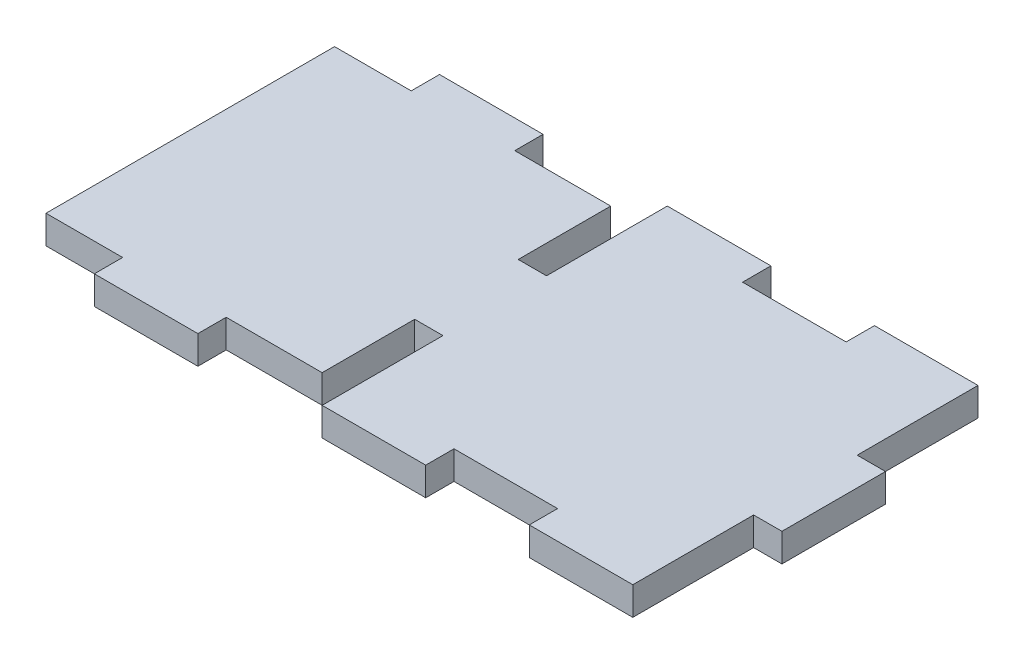
ISO-10303-21;
HEADER;
FILE_DESCRIPTION(('STEP AP214'),'2;1');
FILE_NAME('part.step','',(''),(''),'','','');
FILE_SCHEMA(('AUTOMOTIVE_DESIGN { 1 0 10303 214 1 1 1 1 }'));
ENDSEC;
DATA;
#1=APPLICATION_CONTEXT('core data for automotive mechanical design processes');
#2=APPLICATION_PROTOCOL_DEFINITION('international standard','automotive_design',2000,#1);
#3=PRODUCT_CONTEXT('',#1,'mechanical');
#4=PRODUCT('Part','Part','',(#3));
#5=PRODUCT_RELATED_PRODUCT_CATEGORY('part','',(#4));
#6=PRODUCT_DEFINITION_FORMATION('','',#4);
#7=PRODUCT_DEFINITION_CONTEXT('part definition',#1,'design');
#8=PRODUCT_DEFINITION('design','',#6,#7);
#9=PRODUCT_DEFINITION_SHAPE('','',#8);
#10=(LENGTH_UNIT() NAMED_UNIT(*) SI_UNIT(.MILLI.,.METRE.));
#11=(NAMED_UNIT(*) PLANE_ANGLE_UNIT() SI_UNIT($,.RADIAN.));
#12=(NAMED_UNIT(*) SI_UNIT($,.STERADIAN.) SOLID_ANGLE_UNIT());
#13=UNCERTAINTY_MEASURE_WITH_UNIT(LENGTH_MEASURE(1.E-05),#10,'distance_accuracy_value','');
#14=(GEOMETRIC_REPRESENTATION_CONTEXT(3) GLOBAL_UNCERTAINTY_ASSIGNED_CONTEXT((#13)) GLOBAL_UNIT_ASSIGNED_CONTEXT((#10,
#11,#12)) REPRESENTATION_CONTEXT('',''));
#15=CARTESIAN_POINT('',(0.,0.,0.));
#16=DIRECTION('',(0.,0.,1.));
#17=DIRECTION('',(1.,0.,0.));
#18=AXIS2_PLACEMENT_3D('',#15,#16,#17);
#19=CARTESIAN_POINT('',(0.,4.1,-17.5));
#20=DIRECTION('',(1.,0.,0.));
#21=DIRECTION('',(0.,0.,-1.));
#22=AXIS2_PLACEMENT_3D('',#19,#20,#21);
#23=PLANE('',#22);
#24=DIRECTION('',(0.,0.,1.));
#25=VECTOR('',#24,1.);
#26=CARTESIAN_POINT('',(0.,0.,-17.5));
#27=LINE('',#26,#25);
#28=CARTESIAN_POINT('',(0.,0.,-17.5));
#29=VERTEX_POINT('',#28);
#30=CARTESIAN_POINT('',(0.,0.,0.));
#31=VERTEX_POINT('',#30);
#32=EDGE_CURVE('E273',#29,#31,#27,.T.);
#33=ORIENTED_EDGE('',*,*,#32,.T.);
#34=DIRECTION('',(0.,-1.,0.));
#35=VECTOR('',#34,1.);
#36=CARTESIAN_POINT('',(0.,4.1,0.));
#37=LINE('',#36,#35);
#38=CARTESIAN_POINT('',(0.,4.1,0.));
#39=VERTEX_POINT('',#38);
#40=EDGE_CURVE('E11',#39,#31,#37,.T.);
#41=ORIENTED_EDGE('',*,*,#40,.F.);
#42=DIRECTION('',(0.,0.,1.));
#43=VECTOR('',#42,1.);
#44=CARTESIAN_POINT('',(0.,4.1,-17.5));
#45=LINE('',#44,#43);
#46=CARTESIAN_POINT('',(0.,4.1,-17.5));
#47=VERTEX_POINT('',#46);
#48=EDGE_CURVE('E335',#47,#39,#45,.T.);
#49=ORIENTED_EDGE('',*,*,#48,.F.);
#50=DIRECTION('',(0.,-1.,0.));
#51=VECTOR('',#50,1.);
#52=CARTESIAN_POINT('',(0.,4.1,-17.5));
#53=LINE('',#52,#51);
#54=EDGE_CURVE('E269',#47,#29,#53,.T.);
#55=ORIENTED_EDGE('',*,*,#54,.T.);
#56=EDGE_LOOP('',(#33,#41,#49,#55));
#57=FACE_BOUND('',#56,.T.);
#58=ADVANCED_FACE('F33',(#57),#23,.F.);
#59=CARTESIAN_POINT('',(0.,4.1,0.));
#60=DIRECTION('',(0.,0.,-1.));
#61=DIRECTION('',(-1.,0.,0.));
#62=AXIS2_PLACEMENT_3D('',#59,#60,#61);
#63=PLANE('',#62);
#64=DIRECTION('',(1.,0.,0.));
#65=VECTOR('',#64,1.);
#66=CARTESIAN_POINT('',(0.,0.,0.));
#67=LINE('',#66,#65);
#68=CARTESIAN_POINT('',(15.,0.,0.));
#69=VERTEX_POINT('',#68);
#70=EDGE_CURVE('E276',#31,#69,#67,.T.);
#71=ORIENTED_EDGE('',*,*,#70,.T.);
#72=DIRECTION('',(0.,-1.,0.));
#73=VECTOR('',#72,1.);
#74=CARTESIAN_POINT('',(15.,4.1,0.));
#75=LINE('',#74,#73);
#76=CARTESIAN_POINT('',(15.,4.1,0.));
#77=VERTEX_POINT('',#76);
#78=EDGE_CURVE('E41',#77,#69,#75,.T.);
#79=ORIENTED_EDGE('',*,*,#78,.F.);
#80=DIRECTION('',(1.,0.,0.));
#81=VECTOR('',#80,1.);
#82=CARTESIAN_POINT('',(0.,4.1,0.));
#83=LINE('',#82,#81);
#84=EDGE_CURVE('E164',#39,#77,#83,.T.);
#85=ORIENTED_EDGE('',*,*,#84,.F.);
#86=ORIENTED_EDGE('',*,*,#40,.T.);
#87=EDGE_LOOP('',(#71,#79,#85,#86));
#88=FACE_BOUND('',#87,.T.);
#89=ADVANCED_FACE('F513',(#88),#63,.F.);
#90=CARTESIAN_POINT('',(15.,4.1,0.));
#91=DIRECTION('',(-1.,0.,0.));
#92=DIRECTION('',(0.,0.,1.));
#93=AXIS2_PLACEMENT_3D('',#90,#91,#92);
#94=PLANE('',#93);
#95=DIRECTION('',(0.,0.,-1.));
#96=VECTOR('',#95,1.);
#97=CARTESIAN_POINT('',(15.,0.,0.));
#98=LINE('',#97,#96);
#99=CARTESIAN_POINT('',(15.,0.,-4.1));
#100=VERTEX_POINT('',#99);
#101=EDGE_CURVE('E278',#69,#100,#98,.T.);
#102=ORIENTED_EDGE('',*,*,#101,.T.);
#103=DIRECTION('',(0.,-1.,0.));
#104=VECTOR('',#103,1.);
#105=CARTESIAN_POINT('',(15.,4.1,-4.1));
#106=LINE('',#105,#104);
#107=CARTESIAN_POINT('',(15.,4.1,-4.1));
#108=VERTEX_POINT('',#107);
#109=EDGE_CURVE('E414',#108,#100,#106,.T.);
#110=ORIENTED_EDGE('',*,*,#109,.F.);
#111=DIRECTION('',(0.,0.,-1.));
#112=VECTOR('',#111,1.);
#113=CARTESIAN_POINT('',(15.,4.1,0.));
#114=LINE('',#113,#112);
#115=EDGE_CURVE('E422',#77,#108,#114,.T.);
#116=ORIENTED_EDGE('',*,*,#115,.F.);
#117=ORIENTED_EDGE('',*,*,#78,.T.);
#118=EDGE_LOOP('',(#102,#110,#116,#117));
#119=FACE_BOUND('',#118,.T.);
#120=ADVANCED_FACE('F420',(#119),#94,.F.);
#121=CARTESIAN_POINT('',(15.,4.1,-4.1));
#122=DIRECTION('',(0.,0.,-1.));
#123=DIRECTION('',(-1.,0.,0.));
#124=AXIS2_PLACEMENT_3D('',#121,#122,#123);
#125=PLANE('',#124);
#126=DIRECTION('',(1.,0.,0.));
#127=VECTOR('',#126,1.);
#128=CARTESIAN_POINT('',(15.,0.,-4.1));
#129=LINE('',#128,#127);
#130=CARTESIAN_POINT('',(30.,0.,-4.1));
#131=VERTEX_POINT('',#130);
#132=EDGE_CURVE('E280',#100,#131,#129,.T.);
#133=ORIENTED_EDGE('',*,*,#132,.T.);
#134=DIRECTION('',(0.,-1.,0.));
#135=VECTOR('',#134,1.);
#136=CARTESIAN_POINT('',(30.,4.1,-4.1));
#137=LINE('',#136,#135);
#138=CARTESIAN_POINT('',(30.,4.1,-4.1));
#139=VERTEX_POINT('',#138);
#140=EDGE_CURVE('E411',#139,#131,#137,.T.);
#141=ORIENTED_EDGE('',*,*,#140,.F.);
#142=DIRECTION('',(1.,0.,0.));
#143=VECTOR('',#142,1.);
#144=CARTESIAN_POINT('',(15.,4.1,-4.1));
#145=LINE('',#144,#143);
#146=EDGE_CURVE('E440',#108,#139,#145,.T.);
#147=ORIENTED_EDGE('',*,*,#146,.F.);
#148=ORIENTED_EDGE('',*,*,#109,.T.);
#149=EDGE_LOOP('',(#133,#141,#147,#148));
#150=FACE_BOUND('',#149,.T.);
#151=ADVANCED_FACE('F431',(#150),#125,.F.);
#152=CARTESIAN_POINT('',(30.,4.1,-4.1));
#153=DIRECTION('',(1.,0.,0.));
#154=DIRECTION('',(0.,0.,-1.));
#155=AXIS2_PLACEMENT_3D('',#152,#153,#154);
#156=PLANE('',#155);
#157=DIRECTION('',(0.,0.,1.));
#158=VECTOR('',#157,1.);
#159=CARTESIAN_POINT('',(30.,0.,-4.1));
#160=LINE('',#159,#158);
#161=CARTESIAN_POINT('',(30.,0.,0.));
#162=VERTEX_POINT('',#161);
#163=EDGE_CURVE('E282',#131,#162,#160,.T.);
#164=ORIENTED_EDGE('',*,*,#163,.T.);
#165=DIRECTION('',(0.,-1.,0.));
#166=VECTOR('',#165,1.);
#167=CARTESIAN_POINT('',(30.,4.1,0.));
#168=LINE('',#167,#166);
#169=CARTESIAN_POINT('',(30.,4.1,0.));
#170=VERTEX_POINT('',#169);
#171=EDGE_CURVE('E408',#170,#162,#168,.T.);
#172=ORIENTED_EDGE('',*,*,#171,.F.);
#173=DIRECTION('',(0.,0.,1.));
#174=VECTOR('',#173,1.);
#175=CARTESIAN_POINT('',(30.,4.1,-4.1));
#176=LINE('',#175,#174);
#177=EDGE_CURVE('E437',#139,#170,#176,.T.);
#178=ORIENTED_EDGE('',*,*,#177,.F.);
#179=ORIENTED_EDGE('',*,*,#140,.T.);
#180=EDGE_LOOP('',(#164,#172,#178,#179));
#181=FACE_BOUND('',#180,.T.);
#182=ADVANCED_FACE('F435',(#181),#156,.F.);
#183=CARTESIAN_POINT('',(30.,4.1,0.));
#184=DIRECTION('',(0.,0.,-1.));
#185=DIRECTION('',(-1.,0.,0.));
#186=AXIS2_PLACEMENT_3D('',#183,#184,#185);
#187=PLANE('',#186);
#188=DIRECTION('',(1.,0.,0.));
#189=VECTOR('',#188,1.);
#190=CARTESIAN_POINT('',(30.,0.,0.));
#191=LINE('',#190,#189);
#192=CARTESIAN_POINT('',(45.,0.,0.));
#193=VERTEX_POINT('',#192);
#194=EDGE_CURVE('E284',#162,#193,#191,.T.);
#195=ORIENTED_EDGE('',*,*,#194,.T.);
#196=DIRECTION('',(0.,-1.,0.));
#197=VECTOR('',#196,1.);
#198=CARTESIAN_POINT('',(45.,4.1,0.));
#199=LINE('',#198,#197);
#200=CARTESIAN_POINT('',(45.,4.1,0.));
#201=VERTEX_POINT('',#200);
#202=EDGE_CURVE('E405',#201,#193,#199,.T.);
#203=ORIENTED_EDGE('',*,*,#202,.F.);
#204=DIRECTION('',(1.,0.,0.));
#205=VECTOR('',#204,1.);
#206=CARTESIAN_POINT('',(30.,4.1,0.));
#207=LINE('',#206,#205);
#208=EDGE_CURVE('E439',#170,#201,#207,.T.);
#209=ORIENTED_EDGE('',*,*,#208,.F.);
#210=ORIENTED_EDGE('',*,*,#171,.T.);
#211=EDGE_LOOP('',(#195,#203,#209,#210));
#212=FACE_BOUND('',#211,.T.);
#213=ADVANCED_FACE('F526',(#212),#187,.F.);
#214=CARTESIAN_POINT('',(45.,4.1,0.));
#215=DIRECTION('',(-1.,0.,0.));
#216=DIRECTION('',(0.,0.,1.));
#217=AXIS2_PLACEMENT_3D('',#214,#215,#216);
#218=PLANE('',#217);
#219=DIRECTION('',(0.,0.,-1.));
#220=VECTOR('',#219,1.);
#221=CARTESIAN_POINT('',(45.,0.,0.));
#222=LINE('',#221,#220);
#223=CARTESIAN_POINT('',(45.,0.,-17.5));
#224=VERTEX_POINT('',#223);
#225=EDGE_CURVE('E286',#193,#224,#222,.T.);
#226=ORIENTED_EDGE('',*,*,#225,.T.);
#227=DIRECTION('',(0.,-1.,0.));
#228=VECTOR('',#227,1.);
#229=CARTESIAN_POINT('',(45.,4.1,-17.5));
#230=LINE('',#229,#228);
#231=CARTESIAN_POINT('',(45.,4.1,-17.5));
#232=VERTEX_POINT('',#231);
#233=EDGE_CURVE('E402',#232,#224,#230,.T.);
#234=ORIENTED_EDGE('',*,*,#233,.F.);
#235=DIRECTION('',(0.,0.,-1.));
#236=VECTOR('',#235,1.);
#237=CARTESIAN_POINT('',(45.,4.1,0.));
#238=LINE('',#237,#236);
#239=EDGE_CURVE('E442',#201,#232,#238,.T.);
#240=ORIENTED_EDGE('',*,*,#239,.F.);
#241=ORIENTED_EDGE('',*,*,#202,.T.);
#242=EDGE_LOOP('',(#226,#234,#240,#241));
#243=FACE_BOUND('',#242,.T.);
#244=ADVANCED_FACE('F529',(#243),#218,.F.);
#245=CARTESIAN_POINT('',(49.1,4.1,-17.5));
#246=DIRECTION('',(0.,0.,-1.));
#247=DIRECTION('',(-1.,0.,0.));
#248=AXIS2_PLACEMENT_3D('',#245,#246,#247);
#249=PLANE('',#248);
#250=DIRECTION('',(1.,0.,0.));
#251=VECTOR('',#250,1.);
#252=CARTESIAN_POINT('',(49.1,0.,-17.5));
#253=LINE('',#252,#251);
#254=CARTESIAN_POINT('',(49.1,0.,-17.5));
#255=VERTEX_POINT('',#254);
#256=EDGE_CURVE('E288',#224,#255,#253,.T.);
#257=ORIENTED_EDGE('',*,*,#256,.T.);
#258=DIRECTION('',(0.,-1.,0.));
#259=VECTOR('',#258,1.);
#260=CARTESIAN_POINT('',(49.1,4.1,-17.5));
#261=LINE('',#260,#259);
#262=CARTESIAN_POINT('',(49.1,4.1,-17.5));
#263=VERTEX_POINT('',#262);
#264=EDGE_CURVE('E399',#263,#255,#261,.T.);
#265=ORIENTED_EDGE('',*,*,#264,.F.);
#266=DIRECTION('',(1.,0.,0.));
#267=VECTOR('',#266,1.);
#268=CARTESIAN_POINT('',(49.1,4.1,-17.5));
#269=LINE('',#268,#267);
#270=EDGE_CURVE('E448',#232,#263,#269,.T.);
#271=ORIENTED_EDGE('',*,*,#270,.F.);
#272=ORIENTED_EDGE('',*,*,#233,.T.);
#273=EDGE_LOOP('',(#257,#265,#271,#272));
#274=FACE_BOUND('',#273,.T.);
#275=ADVANCED_FACE('F533',(#274),#249,.F.);
#276=CARTESIAN_POINT('',(49.1,4.1,-32.5));
#277=DIRECTION('',(-1.,0.,0.));
#278=DIRECTION('',(0.,0.,1.));
#279=AXIS2_PLACEMENT_3D('',#276,#277,#278);
#280=PLANE('',#279);
#281=DIRECTION('',(0.,0.,-1.));
#282=VECTOR('',#281,1.);
#283=CARTESIAN_POINT('',(49.1,0.,-32.5));
#284=LINE('',#283,#282);
#285=CARTESIAN_POINT('',(49.1,0.,-32.5));
#286=VERTEX_POINT('',#285);
#287=EDGE_CURVE('E290',#255,#286,#284,.T.);
#288=ORIENTED_EDGE('',*,*,#287,.T.);
#289=DIRECTION('',(0.,-1.,0.));
#290=VECTOR('',#289,1.);
#291=CARTESIAN_POINT('',(49.1,4.1,-32.5));
#292=LINE('',#291,#290);
#293=CARTESIAN_POINT('',(49.1,4.1,-32.5));
#294=VERTEX_POINT('',#293);
#295=EDGE_CURVE('E396',#294,#286,#292,.T.);
#296=ORIENTED_EDGE('',*,*,#295,.F.);
#297=DIRECTION('',(0.,0.,-1.));
#298=VECTOR('',#297,1.);
#299=CARTESIAN_POINT('',(49.1,4.1,-32.5));
#300=LINE('',#299,#298);
#301=EDGE_CURVE('E450',#263,#294,#300,.T.);
#302=ORIENTED_EDGE('',*,*,#301,.F.);
#303=ORIENTED_EDGE('',*,*,#264,.T.);
#304=EDGE_LOOP('',(#288,#296,#302,#303));
#305=FACE_BOUND('',#304,.T.);
#306=ADVANCED_FACE('F537',(#305),#280,.F.);
#307=CARTESIAN_POINT('',(45.,4.1,-32.5));
#308=DIRECTION('',(0.,0.,1.));
#309=DIRECTION('',(1.,0.,0.));
#310=AXIS2_PLACEMENT_3D('',#307,#308,#309);
#311=PLANE('',#310);
#312=DIRECTION('',(-1.,0.,0.));
#313=VECTOR('',#312,1.);
#314=CARTESIAN_POINT('',(45.,0.,-32.5));
#315=LINE('',#314,#313);
#316=CARTESIAN_POINT('',(45.,0.,-32.5));
#317=VERTEX_POINT('',#316);
#318=EDGE_CURVE('E292',#286,#317,#315,.T.);
#319=ORIENTED_EDGE('',*,*,#318,.T.);
#320=DIRECTION('',(0.,-1.,0.));
#321=VECTOR('',#320,1.);
#322=CARTESIAN_POINT('',(45.,4.1,-32.5));
#323=LINE('',#322,#321);
#324=CARTESIAN_POINT('',(45.,4.1,-32.5));
#325=VERTEX_POINT('',#324);
#326=EDGE_CURVE('E393',#325,#317,#323,.T.);
#327=ORIENTED_EDGE('',*,*,#326,.F.);
#328=DIRECTION('',(-1.,0.,0.));
#329=VECTOR('',#328,1.);
#330=CARTESIAN_POINT('',(45.,4.1,-32.5));
#331=LINE('',#330,#329);
#332=EDGE_CURVE('E452',#294,#325,#331,.T.);
#333=ORIENTED_EDGE('',*,*,#332,.F.);
#334=ORIENTED_EDGE('',*,*,#295,.T.);
#335=EDGE_LOOP('',(#319,#327,#333,#334));
#336=FACE_BOUND('',#335,.T.);
#337=ADVANCED_FACE('F541',(#336),#311,.F.);
#338=CARTESIAN_POINT('',(45.,4.1,-32.5));
#339=DIRECTION('',(-1.,0.,0.));
#340=DIRECTION('',(0.,0.,1.));
#341=AXIS2_PLACEMENT_3D('',#338,#339,#340);
#342=PLANE('',#341);
#343=DIRECTION('',(0.,0.,-1.));
#344=VECTOR('',#343,1.);
#345=CARTESIAN_POINT('',(45.,0.,-32.5));
#346=LINE('',#345,#344);
#347=CARTESIAN_POINT('',(45.,0.,-50.));
#348=VERTEX_POINT('',#347);
#349=EDGE_CURVE('E294',#317,#348,#346,.T.);
#350=ORIENTED_EDGE('',*,*,#349,.T.);
#351=DIRECTION('',(0.,-1.,0.));
#352=VECTOR('',#351,1.);
#353=CARTESIAN_POINT('',(45.,4.1,-50.));
#354=LINE('',#353,#352);
#355=CARTESIAN_POINT('',(45.,4.1,-50.));
#356=VERTEX_POINT('',#355);
#357=EDGE_CURVE('E390',#356,#348,#354,.T.);
#358=ORIENTED_EDGE('',*,*,#357,.F.);
#359=DIRECTION('',(0.,0.,-1.));
#360=VECTOR('',#359,1.);
#361=CARTESIAN_POINT('',(45.,4.1,-32.5));
#362=LINE('',#361,#360);
#363=EDGE_CURVE('E454',#325,#356,#362,.T.);
#364=ORIENTED_EDGE('',*,*,#363,.F.);
#365=ORIENTED_EDGE('',*,*,#326,.T.);
#366=EDGE_LOOP('',(#350,#358,#364,#365));
#367=FACE_BOUND('',#366,.T.);
#368=ADVANCED_FACE('F545',(#367),#342,.F.);
#369=CARTESIAN_POINT('',(30.,4.1,-50.));
#370=DIRECTION('',(0.,0.,1.));
#371=DIRECTION('',(1.,0.,0.));
#372=AXIS2_PLACEMENT_3D('',#369,#370,#371);
#373=PLANE('',#372);
#374=DIRECTION('',(-1.,0.,0.));
#375=VECTOR('',#374,1.);
#376=CARTESIAN_POINT('',(30.,0.,-50.));
#377=LINE('',#376,#375);
#378=CARTESIAN_POINT('',(30.,0.,-50.));
#379=VERTEX_POINT('',#378);
#380=EDGE_CURVE('E296',#348,#379,#377,.T.);
#381=ORIENTED_EDGE('',*,*,#380,.T.);
#382=DIRECTION('',(0.,-1.,0.));
#383=VECTOR('',#382,1.);
#384=CARTESIAN_POINT('',(30.,4.1,-50.));
#385=LINE('',#384,#383);
#386=CARTESIAN_POINT('',(30.,4.1,-50.));
#387=VERTEX_POINT('',#386);
#388=EDGE_CURVE('E387',#387,#379,#385,.T.);
#389=ORIENTED_EDGE('',*,*,#388,.F.);
#390=DIRECTION('',(-1.,0.,0.));
#391=VECTOR('',#390,1.);
#392=CARTESIAN_POINT('',(30.,4.1,-50.));
#393=LINE('',#392,#391);
#394=EDGE_CURVE('E456',#356,#387,#393,.T.);
#395=ORIENTED_EDGE('',*,*,#394,.F.);
#396=ORIENTED_EDGE('',*,*,#357,.T.);
#397=EDGE_LOOP('',(#381,#389,#395,#396));
#398=FACE_BOUND('',#397,.T.);
#399=ADVANCED_FACE('F549',(#398),#373,.F.);
#400=CARTESIAN_POINT('',(30.,4.1,-45.9));
#401=DIRECTION('',(1.,0.,0.));
#402=DIRECTION('',(0.,0.,-1.));
#403=AXIS2_PLACEMENT_3D('',#400,#401,#402);
#404=PLANE('',#403);
#405=DIRECTION('',(0.,0.,1.));
#406=VECTOR('',#405,1.);
#407=CARTESIAN_POINT('',(30.,0.,-45.9));
#408=LINE('',#407,#406);
#409=CARTESIAN_POINT('',(30.,0.,-45.9));
#410=VERTEX_POINT('',#409);
#411=EDGE_CURVE('E298',#379,#410,#408,.T.);
#412=ORIENTED_EDGE('',*,*,#411,.T.);
#413=DIRECTION('',(0.,-1.,0.));
#414=VECTOR('',#413,1.);
#415=CARTESIAN_POINT('',(30.,4.1,-45.9));
#416=LINE('',#415,#414);
#417=CARTESIAN_POINT('',(30.,4.1,-45.9));
#418=VERTEX_POINT('',#417);
#419=EDGE_CURVE('E384',#418,#410,#416,.T.);
#420=ORIENTED_EDGE('',*,*,#419,.F.);
#421=DIRECTION('',(0.,0.,1.));
#422=VECTOR('',#421,1.);
#423=CARTESIAN_POINT('',(30.,4.1,-45.9));
#424=LINE('',#423,#422);
#425=EDGE_CURVE('E458',#387,#418,#424,.T.);
#426=ORIENTED_EDGE('',*,*,#425,.F.);
#427=ORIENTED_EDGE('',*,*,#388,.T.);
#428=EDGE_LOOP('',(#412,#420,#426,#427));
#429=FACE_BOUND('',#428,.T.);
#430=ADVANCED_FACE('F553',(#429),#404,.F.);
#431=CARTESIAN_POINT('',(15.,4.1,-45.9));
#432=DIRECTION('',(0.,0.,1.));
#433=DIRECTION('',(1.,0.,0.));
#434=AXIS2_PLACEMENT_3D('',#431,#432,#433);
#435=PLANE('',#434);
#436=DIRECTION('',(-1.,0.,0.));
#437=VECTOR('',#436,1.);
#438=CARTESIAN_POINT('',(15.,0.,-45.9));
#439=LINE('',#438,#437);
#440=CARTESIAN_POINT('',(15.,0.,-45.9));
#441=VERTEX_POINT('',#440);
#442=EDGE_CURVE('E300',#410,#441,#439,.T.);
#443=ORIENTED_EDGE('',*,*,#442,.T.);
#444=DIRECTION('',(0.,-1.,0.));
#445=VECTOR('',#444,1.);
#446=CARTESIAN_POINT('',(15.,4.1,-45.9));
#447=LINE('',#446,#445);
#448=CARTESIAN_POINT('',(15.,4.1,-45.9));
#449=VERTEX_POINT('',#448);
#450=EDGE_CURVE('E381',#449,#441,#447,.T.);
#451=ORIENTED_EDGE('',*,*,#450,.F.);
#452=DIRECTION('',(-1.,0.,0.));
#453=VECTOR('',#452,1.);
#454=CARTESIAN_POINT('',(15.,4.1,-45.9));
#455=LINE('',#454,#453);
#456=EDGE_CURVE('E460',#418,#449,#455,.T.);
#457=ORIENTED_EDGE('',*,*,#456,.F.);
#458=ORIENTED_EDGE('',*,*,#419,.T.);
#459=EDGE_LOOP('',(#443,#451,#457,#458));
#460=FACE_BOUND('',#459,.T.);
#461=ADVANCED_FACE('F557',(#460),#435,.F.);
#462=CARTESIAN_POINT('',(15.,4.1,-50.));
#463=DIRECTION('',(-1.,0.,0.));
#464=DIRECTION('',(0.,0.,1.));
#465=AXIS2_PLACEMENT_3D('',#462,#463,#464);
#466=PLANE('',#465);
#467=DIRECTION('',(0.,0.,-1.));
#468=VECTOR('',#467,1.);
#469=CARTESIAN_POINT('',(15.,0.,-50.));
#470=LINE('',#469,#468);
#471=CARTESIAN_POINT('',(15.,0.,-50.));
#472=VERTEX_POINT('',#471);
#473=EDGE_CURVE('E302',#441,#472,#470,.T.);
#474=ORIENTED_EDGE('',*,*,#473,.T.);
#475=DIRECTION('',(0.,-1.,0.));
#476=VECTOR('',#475,1.);
#477=CARTESIAN_POINT('',(15.,4.1,-50.));
#478=LINE('',#477,#476);
#479=CARTESIAN_POINT('',(15.,4.1,-50.));
#480=VERTEX_POINT('',#479);
#481=EDGE_CURVE('E378',#480,#472,#478,.T.);
#482=ORIENTED_EDGE('',*,*,#481,.F.);
#483=DIRECTION('',(0.,0.,-1.));
#484=VECTOR('',#483,1.);
#485=CARTESIAN_POINT('',(15.,4.1,-50.));
#486=LINE('',#485,#484);
#487=EDGE_CURVE('E462',#449,#480,#486,.T.);
#488=ORIENTED_EDGE('',*,*,#487,.F.);
#489=ORIENTED_EDGE('',*,*,#450,.T.);
#490=EDGE_LOOP('',(#474,#482,#488,#489));
#491=FACE_BOUND('',#490,.T.);
#492=ADVANCED_FACE('F561',(#491),#466,.F.);
#493=CARTESIAN_POINT('',(0.,4.1,-50.));
#494=DIRECTION('',(0.,0.,1.));
#495=DIRECTION('',(1.,0.,0.));
#496=AXIS2_PLACEMENT_3D('',#493,#494,#495);
#497=PLANE('',#496);
#498=DIRECTION('',(-1.,0.,0.));
#499=VECTOR('',#498,1.);
#500=CARTESIAN_POINT('',(0.,0.,-50.));
#501=LINE('',#500,#499);
#502=CARTESIAN_POINT('',(0.,0.,-50.));
#503=VERTEX_POINT('',#502);
#504=EDGE_CURVE('E304',#472,#503,#501,.T.);
#505=ORIENTED_EDGE('',*,*,#504,.T.);
#506=DIRECTION('',(0.,-1.,0.));
#507=VECTOR('',#506,1.);
#508=CARTESIAN_POINT('',(0.,4.1,-50.));
#509=LINE('',#508,#507);
#510=CARTESIAN_POINT('',(0.,4.1,-50.));
#511=VERTEX_POINT('',#510);
#512=EDGE_CURVE('E375',#511,#503,#509,.T.);
#513=ORIENTED_EDGE('',*,*,#512,.F.);
#514=DIRECTION('',(-1.,0.,0.));
#515=VECTOR('',#514,1.);
#516=CARTESIAN_POINT('',(0.,4.1,-50.));
#517=LINE('',#516,#515);
#518=EDGE_CURVE('E464',#480,#511,#517,.T.);
#519=ORIENTED_EDGE('',*,*,#518,.F.);
#520=ORIENTED_EDGE('',*,*,#481,.T.);
#521=EDGE_LOOP('',(#505,#513,#519,#520));
#522=FACE_BOUND('',#521,.T.);
#523=ADVANCED_FACE('F565',(#522),#497,.F.);
#524=CARTESIAN_POINT('',(0.,4.1,-50.));
#525=DIRECTION('',(1.,0.,0.));
#526=DIRECTION('',(0.,0.,-1.));
#527=AXIS2_PLACEMENT_3D('',#524,#525,#526);
#528=PLANE('',#527);
#529=DIRECTION('',(0.,0.,1.));
#530=VECTOR('',#529,1.);
#531=CARTESIAN_POINT('',(0.,0.,-50.));
#532=LINE('',#531,#530);
#533=CARTESIAN_POINT('',(0.,0.,-32.5));
#534=VERTEX_POINT('',#533);
#535=EDGE_CURVE('E306',#503,#534,#532,.T.);
#536=ORIENTED_EDGE('',*,*,#535,.T.);
#537=DIRECTION('',(0.,-1.,0.));
#538=VECTOR('',#537,1.);
#539=CARTESIAN_POINT('',(0.,4.1,-32.5));
#540=LINE('',#539,#538);
#541=CARTESIAN_POINT('',(0.,4.1,-32.5));
#542=VERTEX_POINT('',#541);
#543=EDGE_CURVE('E372',#542,#534,#540,.T.);
#544=ORIENTED_EDGE('',*,*,#543,.F.);
#545=DIRECTION('',(0.,0.,1.));
#546=VECTOR('',#545,1.);
#547=CARTESIAN_POINT('',(0.,4.1,-50.));
#548=LINE('',#547,#546);
#549=EDGE_CURVE('E466',#511,#542,#548,.T.);
#550=ORIENTED_EDGE('',*,*,#549,.F.);
#551=ORIENTED_EDGE('',*,*,#512,.T.);
#552=EDGE_LOOP('',(#536,#544,#550,#551));
#553=FACE_BOUND('',#552,.T.);
#554=ADVANCED_FACE('F569',(#553),#528,.F.);
#555=CARTESIAN_POINT('',(0.,4.1,-32.5));
#556=DIRECTION('',(0.,0.,1.));
#557=DIRECTION('',(1.,0.,0.));
#558=AXIS2_PLACEMENT_3D('',#555,#556,#557);
#559=PLANE('',#558);
#560=DIRECTION('',(-1.,0.,0.));
#561=VECTOR('',#560,1.);
#562=CARTESIAN_POINT('',(0.,0.,-32.5));
#563=LINE('',#562,#561);
#564=CARTESIAN_POINT('',(-4.1,0.,-32.5));
#565=VERTEX_POINT('',#564);
#566=EDGE_CURVE('E308',#534,#565,#563,.T.);
#567=ORIENTED_EDGE('',*,*,#566,.T.);
#568=DIRECTION('',(0.,-1.,0.));
#569=VECTOR('',#568,1.);
#570=CARTESIAN_POINT('',(-4.1,4.1,-32.5));
#571=LINE('',#570,#569);
#572=CARTESIAN_POINT('',(-4.1,4.1,-32.5));
#573=VERTEX_POINT('',#572);
#574=EDGE_CURVE('E369',#573,#565,#571,.T.);
#575=ORIENTED_EDGE('',*,*,#574,.F.);
#576=DIRECTION('',(-1.,0.,0.));
#577=VECTOR('',#576,1.);
#578=CARTESIAN_POINT('',(0.,4.1,-32.5));
#579=LINE('',#578,#577);
#580=EDGE_CURVE('E468',#542,#573,#579,.T.);
#581=ORIENTED_EDGE('',*,*,#580,.F.);
#582=ORIENTED_EDGE('',*,*,#543,.T.);
#583=EDGE_LOOP('',(#567,#575,#581,#582));
#584=FACE_BOUND('',#583,.T.);
#585=ADVANCED_FACE('F573',(#584),#559,.F.);
#586=CARTESIAN_POINT('',(-4.1,4.1,-45.9));
#587=DIRECTION('',(-1.,0.,0.));
#588=DIRECTION('',(0.,0.,1.));
#589=AXIS2_PLACEMENT_3D('',#586,#587,#588);
#590=PLANE('',#589);
#591=DIRECTION('',(0.,0.,-1.));
#592=VECTOR('',#591,1.);
#593=CARTESIAN_POINT('',(-4.1,0.,-45.9));
#594=LINE('',#593,#592);
#595=CARTESIAN_POINT('',(-4.1,0.,-45.9));
#596=VERTEX_POINT('',#595);
#597=EDGE_CURVE('E310',#565,#596,#594,.T.);
#598=ORIENTED_EDGE('',*,*,#597,.T.);
#599=DIRECTION('',(0.,-1.,0.));
#600=VECTOR('',#599,1.);
#601=CARTESIAN_POINT('',(-4.1,4.1,-45.9));
#602=LINE('',#601,#600);
#603=CARTESIAN_POINT('',(-4.1,4.1,-45.9));
#604=VERTEX_POINT('',#603);
#605=EDGE_CURVE('E366',#604,#596,#602,.T.);
#606=ORIENTED_EDGE('',*,*,#605,.F.);
#607=DIRECTION('',(0.,0.,-1.));
#608=VECTOR('',#607,1.);
#609=CARTESIAN_POINT('',(-4.1,4.1,-45.9));
#610=LINE('',#609,#608);
#611=EDGE_CURVE('E470',#573,#604,#610,.T.);
#612=ORIENTED_EDGE('',*,*,#611,.F.);
#613=ORIENTED_EDGE('',*,*,#574,.T.);
#614=EDGE_LOOP('',(#598,#606,#612,#613));
#615=FACE_BOUND('',#614,.T.);
#616=ADVANCED_FACE('F577',(#615),#590,.F.);
#617=CARTESIAN_POINT('',(-4.1,4.1,-45.9));
#618=DIRECTION('',(0.,0.,1.));
#619=DIRECTION('',(1.,0.,0.));
#620=AXIS2_PLACEMENT_3D('',#617,#618,#619);
#621=PLANE('',#620);
#622=DIRECTION('',(-1.,0.,0.));
#623=VECTOR('',#622,1.);
#624=CARTESIAN_POINT('',(-4.1,0.,-45.9));
#625=LINE('',#624,#623);
#626=CARTESIAN_POINT('',(-18.,0.,-45.9));
#627=VERTEX_POINT('',#626);
#628=EDGE_CURVE('E312',#596,#627,#625,.T.);
#629=ORIENTED_EDGE('',*,*,#628,.T.);
#630=DIRECTION('',(0.,-1.,0.));
#631=VECTOR('',#630,1.);
#632=CARTESIAN_POINT('',(-18.,4.1,-45.9));
#633=LINE('',#632,#631);
#634=CARTESIAN_POINT('',(-18.,4.1,-45.9));
#635=VERTEX_POINT('',#634);
#636=EDGE_CURVE('E363',#635,#627,#633,.T.);
#637=ORIENTED_EDGE('',*,*,#636,.F.);
#638=DIRECTION('',(-1.,0.,0.));
#639=VECTOR('',#638,1.);
#640=CARTESIAN_POINT('',(-4.1,4.1,-45.9));
#641=LINE('',#640,#639);
#642=EDGE_CURVE('E472',#604,#635,#641,.T.);
#643=ORIENTED_EDGE('',*,*,#642,.F.);
#644=ORIENTED_EDGE('',*,*,#605,.T.);
#645=EDGE_LOOP('',(#629,#637,#643,#644));
#646=FACE_BOUND('',#645,.T.);
#647=ADVANCED_FACE('F581',(#646),#621,.F.);
#648=CARTESIAN_POINT('',(-18.,4.1,-45.9));
#649=DIRECTION('',(-1.,0.,0.));
#650=DIRECTION('',(0.,0.,1.));
#651=AXIS2_PLACEMENT_3D('',#648,#649,#650);
#652=PLANE('',#651);
#653=DIRECTION('',(0.,0.,-1.));
#654=VECTOR('',#653,1.);
#655=CARTESIAN_POINT('',(-18.,0.,-45.9));
#656=LINE('',#655,#654);
#657=CARTESIAN_POINT('',(-18.,0.,-50.));
#658=VERTEX_POINT('',#657);
#659=EDGE_CURVE('E314',#627,#658,#656,.T.);
#660=ORIENTED_EDGE('',*,*,#659,.T.);
#661=DIRECTION('',(0.,-1.,0.));
#662=VECTOR('',#661,1.);
#663=CARTESIAN_POINT('',(-18.,4.1,-50.));
#664=LINE('',#663,#662);
#665=CARTESIAN_POINT('',(-18.,4.1,-50.));
#666=VERTEX_POINT('',#665);
#667=EDGE_CURVE('E360',#666,#658,#664,.T.);
#668=ORIENTED_EDGE('',*,*,#667,.F.);
#669=DIRECTION('',(0.,0.,-1.));
#670=VECTOR('',#669,1.);
#671=CARTESIAN_POINT('',(-18.,4.1,-45.9));
#672=LINE('',#671,#670);
#673=EDGE_CURVE('E474',#635,#666,#672,.T.);
#674=ORIENTED_EDGE('',*,*,#673,.F.);
#675=ORIENTED_EDGE('',*,*,#636,.T.);
#676=EDGE_LOOP('',(#660,#668,#674,#675));
#677=FACE_BOUND('',#676,.T.);
#678=ADVANCED_FACE('F585',(#677),#652,.F.);
#679=CARTESIAN_POINT('',(-18.,4.1,-50.));
#680=DIRECTION('',(0.,0.,1.));
#681=DIRECTION('',(1.,0.,0.));
#682=AXIS2_PLACEMENT_3D('',#679,#680,#681);
#683=PLANE('',#682);
#684=DIRECTION('',(-1.,0.,0.));
#685=VECTOR('',#684,1.);
#686=CARTESIAN_POINT('',(-18.,0.,-50.));
#687=LINE('',#686,#685);
#688=CARTESIAN_POINT('',(-33.,0.,-50.));
#689=VERTEX_POINT('',#688);
#690=EDGE_CURVE('E316',#658,#689,#687,.T.);
#691=ORIENTED_EDGE('',*,*,#690,.T.);
#692=DIRECTION('',(0.,-1.,0.));
#693=VECTOR('',#692,1.);
#694=CARTESIAN_POINT('',(-33.,4.1,-50.));
#695=LINE('',#694,#693);
#696=CARTESIAN_POINT('',(-33.,4.1,-50.));
#697=VERTEX_POINT('',#696);
#698=EDGE_CURVE('E357',#697,#689,#695,.T.);
#699=ORIENTED_EDGE('',*,*,#698,.F.);
#700=DIRECTION('',(-1.,0.,0.));
#701=VECTOR('',#700,1.);
#702=CARTESIAN_POINT('',(-18.,4.1,-50.));
#703=LINE('',#702,#701);
#704=EDGE_CURVE('E476',#666,#697,#703,.T.);
#705=ORIENTED_EDGE('',*,*,#704,.F.);
#706=ORIENTED_EDGE('',*,*,#667,.T.);
#707=EDGE_LOOP('',(#691,#699,#705,#706));
#708=FACE_BOUND('',#707,.T.);
#709=ADVANCED_FACE('F589',(#708),#683,.F.);
#710=CARTESIAN_POINT('',(-33.,4.1,-45.9));
#711=DIRECTION('',(1.,0.,0.));
#712=DIRECTION('',(0.,0.,-1.));
#713=AXIS2_PLACEMENT_3D('',#710,#711,#712);
#714=PLANE('',#713);
#715=DIRECTION('',(0.,0.,1.));
#716=VECTOR('',#715,1.);
#717=CARTESIAN_POINT('',(-33.,0.,-45.9));
#718=LINE('',#717,#716);
#719=CARTESIAN_POINT('',(-33.,0.,-45.9));
#720=VERTEX_POINT('',#719);
#721=EDGE_CURVE('E318',#689,#720,#718,.T.);
#722=ORIENTED_EDGE('',*,*,#721,.T.);
#723=DIRECTION('',(0.,-1.,0.));
#724=VECTOR('',#723,1.);
#725=CARTESIAN_POINT('',(-33.,4.1,-45.9));
#726=LINE('',#725,#724);
#727=CARTESIAN_POINT('',(-33.,4.1,-45.9));
#728=VERTEX_POINT('',#727);
#729=EDGE_CURVE('E354',#728,#720,#726,.T.);
#730=ORIENTED_EDGE('',*,*,#729,.F.);
#731=DIRECTION('',(0.,0.,1.));
#732=VECTOR('',#731,1.);
#733=CARTESIAN_POINT('',(-33.,4.1,-45.9));
#734=LINE('',#733,#732);
#735=EDGE_CURVE('E478',#697,#728,#734,.T.);
#736=ORIENTED_EDGE('',*,*,#735,.F.);
#737=ORIENTED_EDGE('',*,*,#698,.T.);
#738=EDGE_LOOP('',(#722,#730,#736,#737));
#739=FACE_BOUND('',#738,.T.);
#740=ADVANCED_FACE('F593',(#739),#714,.F.);
#741=CARTESIAN_POINT('',(-33.,4.1,-45.9));
#742=DIRECTION('',(0.,0.,1.));
#743=DIRECTION('',(1.,0.,0.));
#744=AXIS2_PLACEMENT_3D('',#741,#742,#743);
#745=PLANE('',#744);
#746=DIRECTION('',(-1.,0.,0.));
#747=VECTOR('',#746,1.);
#748=CARTESIAN_POINT('',(-33.,0.,-45.9));
#749=LINE('',#748,#747);
#750=CARTESIAN_POINT('',(-44.1,0.,-45.9));
#751=VERTEX_POINT('',#750);
#752=EDGE_CURVE('E320',#720,#751,#749,.T.);
#753=ORIENTED_EDGE('',*,*,#752,.T.);
#754=DIRECTION('',(0.,-1.,0.));
#755=VECTOR('',#754,1.);
#756=CARTESIAN_POINT('',(-44.1,4.1,-45.9));
#757=LINE('',#756,#755);
#758=CARTESIAN_POINT('',(-44.1,4.1,-45.9));
#759=VERTEX_POINT('',#758);
#760=EDGE_CURVE('E351',#759,#751,#757,.T.);
#761=ORIENTED_EDGE('',*,*,#760,.F.);
#762=DIRECTION('',(-1.,0.,0.));
#763=VECTOR('',#762,1.);
#764=CARTESIAN_POINT('',(-33.,4.1,-45.9));
#765=LINE('',#764,#763);
#766=EDGE_CURVE('E480',#728,#759,#765,.T.);
#767=ORIENTED_EDGE('',*,*,#766,.F.);
#768=ORIENTED_EDGE('',*,*,#729,.T.);
#769=EDGE_LOOP('',(#753,#761,#767,#768));
#770=FACE_BOUND('',#769,.T.);
#771=ADVANCED_FACE('F597',(#770),#745,.F.);
#772=CARTESIAN_POINT('',(-44.1,4.1,-45.9));
#773=DIRECTION('',(1.,0.,0.));
#774=DIRECTION('',(0.,0.,-1.));
#775=AXIS2_PLACEMENT_3D('',#772,#773,#774);
#776=PLANE('',#775);
#777=DIRECTION('',(0.,0.,1.));
#778=VECTOR('',#777,1.);
#779=CARTESIAN_POINT('',(-44.1,0.,-45.9));
#780=LINE('',#779,#778);
#781=CARTESIAN_POINT('',(-44.1,0.,-4.09999999999999));
#782=VERTEX_POINT('',#781);
#783=EDGE_CURVE('E322',#751,#782,#780,.T.);
#784=ORIENTED_EDGE('',*,*,#783,.T.);
#785=DIRECTION('',(0.,-1.,0.));
#786=VECTOR('',#785,1.);
#787=CARTESIAN_POINT('',(-44.1,4.1,-4.09999999999999));
#788=LINE('',#787,#786);
#789=CARTESIAN_POINT('',(-44.1,4.1,-4.09999999999999));
#790=VERTEX_POINT('',#789);
#791=EDGE_CURVE('E348',#790,#782,#788,.T.);
#792=ORIENTED_EDGE('',*,*,#791,.F.);
#793=DIRECTION('',(0.,0.,1.));
#794=VECTOR('',#793,1.);
#795=CARTESIAN_POINT('',(-44.1,4.1,-45.9));
#796=LINE('',#795,#794);
#797=EDGE_CURVE('E482',#759,#790,#796,.T.);
#798=ORIENTED_EDGE('',*,*,#797,.F.);
#799=ORIENTED_EDGE('',*,*,#760,.T.);
#800=EDGE_LOOP('',(#784,#792,#798,#799));
#801=FACE_BOUND('',#800,.T.);
#802=ADVANCED_FACE('F601',(#801),#776,.F.);
#803=CARTESIAN_POINT('',(-33.,4.1,-4.1));
#804=DIRECTION('',(0.,0.,-1.));
#805=DIRECTION('',(-1.,0.,0.));
#806=AXIS2_PLACEMENT_3D('',#803,#804,#805);
#807=PLANE('',#806);
#808=DIRECTION('',(1.,0.,0.));
#809=VECTOR('',#808,1.);
#810=CARTESIAN_POINT('',(-33.,0.,-4.1));
#811=LINE('',#810,#809);
#812=CARTESIAN_POINT('',(-33.,0.,-4.1));
#813=VERTEX_POINT('',#812);
#814=EDGE_CURVE('E324',#782,#813,#811,.T.);
#815=ORIENTED_EDGE('',*,*,#814,.T.);
#816=DIRECTION('',(0.,-1.,0.));
#817=VECTOR('',#816,1.);
#818=CARTESIAN_POINT('',(-33.,4.1,-4.1));
#819=LINE('',#818,#817);
#820=CARTESIAN_POINT('',(-33.,4.1,-4.1));
#821=VERTEX_POINT('',#820);
#822=EDGE_CURVE('E345',#821,#813,#819,.T.);
#823=ORIENTED_EDGE('',*,*,#822,.F.);
#824=DIRECTION('',(1.,0.,0.));
#825=VECTOR('',#824,1.);
#826=CARTESIAN_POINT('',(-33.,4.1,-4.1));
#827=LINE('',#826,#825);
#828=EDGE_CURVE('E484',#790,#821,#827,.T.);
#829=ORIENTED_EDGE('',*,*,#828,.F.);
#830=ORIENTED_EDGE('',*,*,#791,.T.);
#831=EDGE_LOOP('',(#815,#823,#829,#830));
#832=FACE_BOUND('',#831,.T.);
#833=ADVANCED_FACE('F605',(#832),#807,.F.);
#834=CARTESIAN_POINT('',(-33.,4.1,-4.1));
#835=DIRECTION('',(1.,0.,0.));
#836=DIRECTION('',(0.,0.,-1.));
#837=AXIS2_PLACEMENT_3D('',#834,#835,#836);
#838=PLANE('',#837);
#839=DIRECTION('',(0.,0.,1.));
#840=VECTOR('',#839,1.);
#841=CARTESIAN_POINT('',(-33.,0.,-4.1));
#842=LINE('',#841,#840);
#843=CARTESIAN_POINT('',(-33.,0.,0.));
#844=VERTEX_POINT('',#843);
#845=EDGE_CURVE('E326',#813,#844,#842,.T.);
#846=ORIENTED_EDGE('',*,*,#845,.T.);
#847=DIRECTION('',(0.,-1.,0.));
#848=VECTOR('',#847,1.);
#849=CARTESIAN_POINT('',(-33.,4.1,0.));
#850=LINE('',#849,#848);
#851=CARTESIAN_POINT('',(-33.,4.1,0.));
#852=VERTEX_POINT('',#851);
#853=EDGE_CURVE('E342',#852,#844,#850,.T.);
#854=ORIENTED_EDGE('',*,*,#853,.F.);
#855=DIRECTION('',(0.,0.,1.));
#856=VECTOR('',#855,1.);
#857=CARTESIAN_POINT('',(-33.,4.1,-4.1));
#858=LINE('',#857,#856);
#859=EDGE_CURVE('E486',#821,#852,#858,.T.);
#860=ORIENTED_EDGE('',*,*,#859,.F.);
#861=ORIENTED_EDGE('',*,*,#822,.T.);
#862=EDGE_LOOP('',(#846,#854,#860,#861));
#863=FACE_BOUND('',#862,.T.);
#864=ADVANCED_FACE('F609',(#863),#838,.F.);
#865=CARTESIAN_POINT('',(-18.,4.1,0.));
#866=DIRECTION('',(0.,0.,-1.));
#867=DIRECTION('',(-1.,0.,0.));
#868=AXIS2_PLACEMENT_3D('',#865,#866,#867);
#869=PLANE('',#868);
#870=DIRECTION('',(1.,0.,0.));
#871=VECTOR('',#870,1.);
#872=CARTESIAN_POINT('',(-18.,0.,0.));
#873=LINE('',#872,#871);
#874=CARTESIAN_POINT('',(-18.,0.,0.));
#875=VERTEX_POINT('',#874);
#876=EDGE_CURVE('E328',#844,#875,#873,.T.);
#877=ORIENTED_EDGE('',*,*,#876,.T.);
#878=DIRECTION('',(0.,-1.,0.));
#879=VECTOR('',#878,1.);
#880=CARTESIAN_POINT('',(-18.,4.1,0.));
#881=LINE('',#880,#879);
#882=CARTESIAN_POINT('',(-18.,4.1,0.));
#883=VERTEX_POINT('',#882);
#884=EDGE_CURVE('E339',#883,#875,#881,.T.);
#885=ORIENTED_EDGE('',*,*,#884,.F.);
#886=DIRECTION('',(1.,0.,0.));
#887=VECTOR('',#886,1.);
#888=CARTESIAN_POINT('',(-18.,4.1,0.));
#889=LINE('',#888,#887);
#890=EDGE_CURVE('E488',#852,#883,#889,.T.);
#891=ORIENTED_EDGE('',*,*,#890,.F.);
#892=ORIENTED_EDGE('',*,*,#853,.T.);
#893=EDGE_LOOP('',(#877,#885,#891,#892));
#894=FACE_BOUND('',#893,.T.);
#895=ADVANCED_FACE('F494',(#894),#869,.F.);
#896=CARTESIAN_POINT('',(-18.,4.1,-4.1));
#897=DIRECTION('',(-1.,0.,0.));
#898=DIRECTION('',(0.,0.,1.));
#899=AXIS2_PLACEMENT_3D('',#896,#897,#898);
#900=PLANE('',#899);
#901=DIRECTION('',(0.,0.,-1.));
#902=VECTOR('',#901,1.);
#903=CARTESIAN_POINT('',(-18.,0.,-4.1));
#904=LINE('',#903,#902);
#905=CARTESIAN_POINT('',(-18.,0.,-4.1));
#906=VERTEX_POINT('',#905);
#907=EDGE_CURVE('E330',#875,#906,#904,.T.);
#908=ORIENTED_EDGE('',*,*,#907,.T.);
#909=DIRECTION('',(0.,-1.,0.));
#910=VECTOR('',#909,1.);
#911=CARTESIAN_POINT('',(-18.,4.1,-4.1));
#912=LINE('',#911,#910);
#913=CARTESIAN_POINT('',(-18.,4.1,-4.1));
#914=VERTEX_POINT('',#913);
#915=EDGE_CURVE('E264',#914,#906,#912,.T.);
#916=ORIENTED_EDGE('',*,*,#915,.F.);
#917=DIRECTION('',(0.,0.,-1.));
#918=VECTOR('',#917,1.);
#919=CARTESIAN_POINT('',(-18.,4.1,-4.1));
#920=LINE('',#919,#918);
#921=EDGE_CURVE('E255',#883,#914,#920,.T.);
#922=ORIENTED_EDGE('',*,*,#921,.F.);
#923=ORIENTED_EDGE('',*,*,#884,.T.);
#924=EDGE_LOOP('',(#908,#916,#922,#923));
#925=FACE_BOUND('',#924,.T.);
#926=ADVANCED_FACE('F498',(#925),#900,.F.);
#927=CARTESIAN_POINT('',(-4.1,4.1,-4.1));
#928=DIRECTION('',(0.,0.,-1.));
#929=DIRECTION('',(-1.,0.,0.));
#930=AXIS2_PLACEMENT_3D('',#927,#928,#929);
#931=PLANE('',#930);
#932=DIRECTION('',(1.,0.,0.));
#933=VECTOR('',#932,1.);
#934=CARTESIAN_POINT('',(-4.1,0.,-4.1));
#935=LINE('',#934,#933);
#936=CARTESIAN_POINT('',(-4.1,0.,-4.1));
#937=VERTEX_POINT('',#936);
#938=EDGE_CURVE('E263',#906,#937,#935,.T.);
#939=ORIENTED_EDGE('',*,*,#938,.T.);
#940=DIRECTION('',(0.,-1.,0.));
#941=VECTOR('',#940,1.);
#942=CARTESIAN_POINT('',(-4.1,4.1,-4.1));
#943=LINE('',#942,#941);
#944=CARTESIAN_POINT('',(-4.1,4.1,-4.1));
#945=VERTEX_POINT('',#944);
#946=EDGE_CURVE('E260',#945,#937,#943,.T.);
#947=ORIENTED_EDGE('',*,*,#946,.F.);
#948=DIRECTION('',(1.,0.,0.));
#949=VECTOR('',#948,1.);
#950=CARTESIAN_POINT('',(-4.1,4.1,-4.1));
#951=LINE('',#950,#949);
#952=EDGE_CURVE('E249',#914,#945,#951,.T.);
#953=ORIENTED_EDGE('',*,*,#952,.F.);
#954=ORIENTED_EDGE('',*,*,#915,.T.);
#955=EDGE_LOOP('',(#939,#947,#953,#954));
#956=FACE_BOUND('',#955,.T.);
#957=ADVANCED_FACE('F261',(#956),#931,.F.);
#958=CARTESIAN_POINT('',(-4.1,4.1,-17.5));
#959=DIRECTION('',(-1.,0.,0.));
#960=DIRECTION('',(0.,0.,1.));
#961=AXIS2_PLACEMENT_3D('',#958,#959,#960);
#962=PLANE('',#961);
#963=DIRECTION('',(0.,0.,-1.));
#964=VECTOR('',#963,1.);
#965=CARTESIAN_POINT('',(-4.1,0.,-17.5));
#966=LINE('',#965,#964);
#967=CARTESIAN_POINT('',(-4.1,0.,-17.5));
#968=VERTEX_POINT('',#967);
#969=EDGE_CURVE('E150',#937,#968,#966,.T.);
#970=ORIENTED_EDGE('',*,*,#969,.T.);
#971=DIRECTION('',(0.,-1.,0.));
#972=VECTOR('',#971,1.);
#973=CARTESIAN_POINT('',(-4.1,4.1,-17.5));
#974=LINE('',#973,#972);
#975=CARTESIAN_POINT('',(-4.1,4.1,-17.5));
#976=VERTEX_POINT('',#975);
#977=EDGE_CURVE('E265',#976,#968,#974,.T.);
#978=ORIENTED_EDGE('',*,*,#977,.F.);
#979=DIRECTION('',(0.,0.,-1.));
#980=VECTOR('',#979,1.);
#981=CARTESIAN_POINT('',(-4.1,4.1,-17.5));
#982=LINE('',#981,#980);
#983=EDGE_CURVE('E253',#945,#976,#982,.T.);
#984=ORIENTED_EDGE('',*,*,#983,.F.);
#985=ORIENTED_EDGE('',*,*,#946,.T.);
#986=EDGE_LOOP('',(#970,#978,#984,#985));
#987=FACE_BOUND('',#986,.T.);
#988=ADVANCED_FACE('F267',(#987),#962,.F.);
#989=CARTESIAN_POINT('',(-4.1,4.1,-17.5));
#990=DIRECTION('',(0.,0.,-1.));
#991=DIRECTION('',(-1.,0.,0.));
#992=AXIS2_PLACEMENT_3D('',#989,#990,#991);
#993=PLANE('',#992);
#994=DIRECTION('',(1.,0.,0.));
#995=VECTOR('',#994,1.);
#996=CARTESIAN_POINT('',(-4.1,0.,-17.5));
#997=LINE('',#996,#995);
#998=EDGE_CURVE('E156',#968,#29,#997,.T.);
#999=ORIENTED_EDGE('',*,*,#998,.T.);
#1000=ORIENTED_EDGE('',*,*,#54,.F.);
#1001=DIRECTION('',(1.,0.,0.));
#1002=VECTOR('',#1001,1.);
#1003=CARTESIAN_POINT('',(-4.1,4.1,-17.5));
#1004=LINE('',#1003,#1002);
#1005=EDGE_CURVE('E49',#976,#47,#1004,.T.);
#1006=ORIENTED_EDGE('',*,*,#1005,.F.);
#1007=ORIENTED_EDGE('',*,*,#977,.T.);
#1008=EDGE_LOOP('',(#999,#1000,#1006,#1007));
#1009=FACE_BOUND('',#1008,.T.);
#1010=ADVANCED_FACE('F502',(#1009),#993,.F.);
#1011=CARTESIAN_POINT('',(0.,4.1,0.));
#1012=DIRECTION('',(0.,1.,0.));
#1013=DIRECTION('',(0.,0.,1.));
#1014=AXIS2_PLACEMENT_3D('',#1011,#1012,#1013);
#1015=PLANE('',#1014);
#1016=ORIENTED_EDGE('',*,*,#48,.T.);
#1017=ORIENTED_EDGE('',*,*,#84,.T.);
#1018=ORIENTED_EDGE('',*,*,#115,.T.);
#1019=ORIENTED_EDGE('',*,*,#146,.T.);
#1020=ORIENTED_EDGE('',*,*,#177,.T.);
#1021=ORIENTED_EDGE('',*,*,#208,.T.);
#1022=ORIENTED_EDGE('',*,*,#239,.T.);
#1023=ORIENTED_EDGE('',*,*,#270,.T.);
#1024=ORIENTED_EDGE('',*,*,#301,.T.);
#1025=ORIENTED_EDGE('',*,*,#332,.T.);
#1026=ORIENTED_EDGE('',*,*,#363,.T.);
#1027=ORIENTED_EDGE('',*,*,#394,.T.);
#1028=ORIENTED_EDGE('',*,*,#425,.T.);
#1029=ORIENTED_EDGE('',*,*,#456,.T.);
#1030=ORIENTED_EDGE('',*,*,#487,.T.);
#1031=ORIENTED_EDGE('',*,*,#518,.T.);
#1032=ORIENTED_EDGE('',*,*,#549,.T.);
#1033=ORIENTED_EDGE('',*,*,#580,.T.);
#1034=ORIENTED_EDGE('',*,*,#611,.T.);
#1035=ORIENTED_EDGE('',*,*,#642,.T.);
#1036=ORIENTED_EDGE('',*,*,#673,.T.);
#1037=ORIENTED_EDGE('',*,*,#704,.T.);
#1038=ORIENTED_EDGE('',*,*,#735,.T.);
#1039=ORIENTED_EDGE('',*,*,#766,.T.);
#1040=ORIENTED_EDGE('',*,*,#797,.T.);
#1041=ORIENTED_EDGE('',*,*,#828,.T.);
#1042=ORIENTED_EDGE('',*,*,#859,.T.);
#1043=ORIENTED_EDGE('',*,*,#890,.T.);
#1044=ORIENTED_EDGE('',*,*,#921,.T.);
#1045=ORIENTED_EDGE('',*,*,#952,.T.);
#1046=ORIENTED_EDGE('',*,*,#983,.T.);
#1047=ORIENTED_EDGE('',*,*,#1005,.T.);
#1048=EDGE_LOOP('',(#1016,#1017,#1018,#1019,#1020,#1021,#1022,#1023,#1024,#1025,#1026,#1027,
#1028,#1029,#1030,#1031,#1032,#1033,#1034,#1035,#1036,#1037,#1038,#1039,#1040,#1041,#1042,#1043,
#1044,#1045,#1046,#1047));
#1049=FACE_BOUND('',#1048,.T.);
#1050=ADVANCED_FACE('F251',(#1049),#1015,.T.);
#1051=CARTESIAN_POINT('',(0.,0.,0.));
#1052=DIRECTION('',(0.,1.,0.));
#1053=DIRECTION('',(0.,0.,1.));
#1054=AXIS2_PLACEMENT_3D('',#1051,#1052,#1053);
#1055=PLANE('',#1054);
#1056=ORIENTED_EDGE('',*,*,#32,.F.);
#1057=ORIENTED_EDGE('',*,*,#998,.F.);
#1058=ORIENTED_EDGE('',*,*,#969,.F.);
#1059=ORIENTED_EDGE('',*,*,#938,.F.);
#1060=ORIENTED_EDGE('',*,*,#907,.F.);
#1061=ORIENTED_EDGE('',*,*,#876,.F.);
#1062=ORIENTED_EDGE('',*,*,#845,.F.);
#1063=ORIENTED_EDGE('',*,*,#814,.F.);
#1064=ORIENTED_EDGE('',*,*,#783,.F.);
#1065=ORIENTED_EDGE('',*,*,#752,.F.);
#1066=ORIENTED_EDGE('',*,*,#721,.F.);
#1067=ORIENTED_EDGE('',*,*,#690,.F.);
#1068=ORIENTED_EDGE('',*,*,#659,.F.);
#1069=ORIENTED_EDGE('',*,*,#628,.F.);
#1070=ORIENTED_EDGE('',*,*,#597,.F.);
#1071=ORIENTED_EDGE('',*,*,#566,.F.);
#1072=ORIENTED_EDGE('',*,*,#535,.F.);
#1073=ORIENTED_EDGE('',*,*,#504,.F.);
#1074=ORIENTED_EDGE('',*,*,#473,.F.);
#1075=ORIENTED_EDGE('',*,*,#442,.F.);
#1076=ORIENTED_EDGE('',*,*,#411,.F.);
#1077=ORIENTED_EDGE('',*,*,#380,.F.);
#1078=ORIENTED_EDGE('',*,*,#349,.F.);
#1079=ORIENTED_EDGE('',*,*,#318,.F.);
#1080=ORIENTED_EDGE('',*,*,#287,.F.);
#1081=ORIENTED_EDGE('',*,*,#256,.F.);
#1082=ORIENTED_EDGE('',*,*,#225,.F.);
#1083=ORIENTED_EDGE('',*,*,#194,.F.);
#1084=ORIENTED_EDGE('',*,*,#163,.F.);
#1085=ORIENTED_EDGE('',*,*,#132,.F.);
#1086=ORIENTED_EDGE('',*,*,#101,.F.);
#1087=ORIENTED_EDGE('',*,*,#70,.F.);
#1088=EDGE_LOOP('',(#1056,#1057,#1058,#1059,#1060,#1061,#1062,#1063,#1064,#1065,#1066,#1067,
#1068,#1069,#1070,#1071,#1072,#1073,#1074,#1075,#1076,#1077,#1078,#1079,#1080,#1081,#1082,#1083,
#1084,#1085,#1086,#1087));
#1089=FACE_BOUND('',#1088,.T.);
#1090=ADVANCED_FACE('F426',(#1089),#1055,.F.);
#1091=CLOSED_SHELL('',(#58,#89,#120,#151,#182,#213,#244,#275,#306,#337,#368,#399,#430,#461,#492,
#523,#554,#585,#616,#647,#678,#709,#740,#771,#802,#833,#864,#895,#926,#957,#988,#1010,#1050,#1090));
#1092=MANIFOLD_SOLID_BREP('B2',#1091);
#1093=ADVANCED_BREP_SHAPE_REPRESENTATION('',(#18,#1092),#14);
#1094=SHAPE_DEFINITION_REPRESENTATION(#9,#1093);
ENDSEC;
END-ISO-10303-21;
